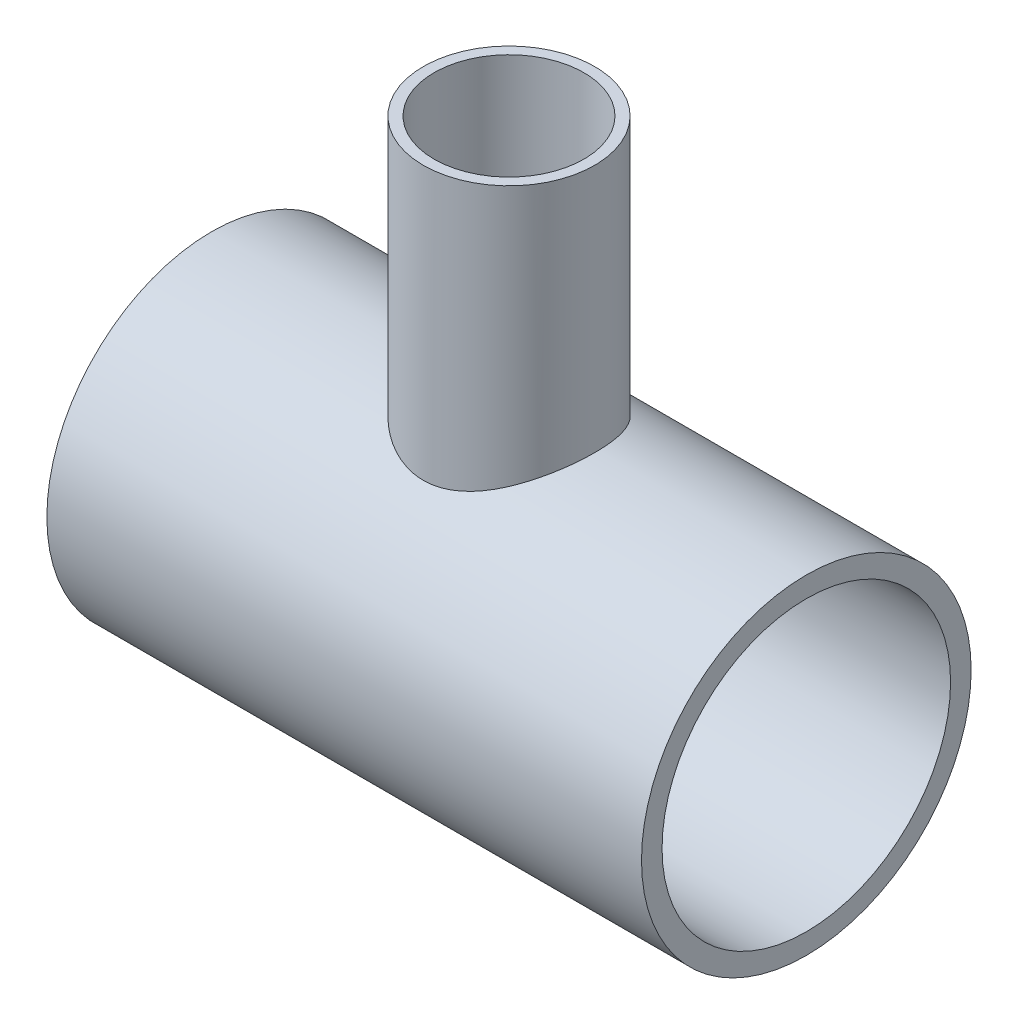
ISO-10303-21;
HEADER;
FILE_DESCRIPTION(('STEP AP214'),'2;1');
FILE_NAME('part.step','',(''),(''),'','','');
FILE_SCHEMA(('AUTOMOTIVE_DESIGN { 1 0 10303 214 1 1 1 1 }'));
ENDSEC;
DATA;
#1=APPLICATION_CONTEXT('core data for automotive mechanical design processes');
#2=APPLICATION_PROTOCOL_DEFINITION('international standard','automotive_design',2000,#1);
#3=PRODUCT_CONTEXT('',#1,'mechanical');
#4=PRODUCT('Part','Part','',(#3));
#5=PRODUCT_RELATED_PRODUCT_CATEGORY('part','',(#4));
#6=PRODUCT_DEFINITION_FORMATION('','',#4);
#7=PRODUCT_DEFINITION_CONTEXT('part definition',#1,'design');
#8=PRODUCT_DEFINITION('design','',#6,#7);
#9=PRODUCT_DEFINITION_SHAPE('','',#8);
#10=(LENGTH_UNIT() NAMED_UNIT(*) SI_UNIT(.MILLI.,.METRE.));
#11=(NAMED_UNIT(*) PLANE_ANGLE_UNIT() SI_UNIT($,.RADIAN.));
#12=(NAMED_UNIT(*) SI_UNIT($,.STERADIAN.) SOLID_ANGLE_UNIT());
#13=UNCERTAINTY_MEASURE_WITH_UNIT(LENGTH_MEASURE(1.E-05),#10,'distance_accuracy_value','');
#14=(GEOMETRIC_REPRESENTATION_CONTEXT(3) GLOBAL_UNCERTAINTY_ASSIGNED_CONTEXT((#13)) GLOBAL_UNIT_ASSIGNED_CONTEXT((#10,
#11,#12)) REPRESENTATION_CONTEXT('',''));
#15=CARTESIAN_POINT('',(0.,0.,0.));
#16=DIRECTION('',(0.,0.,1.));
#17=DIRECTION('',(1.,0.,0.));
#18=AXIS2_PLACEMENT_3D('',#15,#16,#17);
#19=CARTESIAN_POINT('',(-292.1,161.925,0.));
#20=DIRECTION('',(1.,0.,0.));
#21=DIRECTION('',(0.,0.,-1.));
#22=AXIS2_PLACEMENT_3D('',#19,#20,#21);
#23=PLANE('',#22);
#24=CARTESIAN_POINT('',(-292.1,0.,0.));
#25=DIRECTION('',(-1.,0.,0.));
#26=DIRECTION('',(0.,0.,1.));
#27=AXIS2_PLACEMENT_3D('',#24,#25,#26);
#28=CIRCLE('',#27,141.732);
#29=CARTESIAN_POINT('',(-292.1,0.,141.732));
#30=VERTEX_POINT('',#29);
#31=EDGE_CURVE('E10',#30,#30,#28,.T.);
#32=ORIENTED_EDGE('',*,*,#31,.F.);
#33=EDGE_LOOP('',(#32));
#34=FACE_BOUND('',#33,.T.);
#35=CARTESIAN_POINT('',(-292.1,0.,0.));
#36=DIRECTION('',(-1.,0.,0.));
#37=DIRECTION('',(0.,0.,1.));
#38=AXIS2_PLACEMENT_3D('',#35,#36,#37);
#39=CIRCLE('',#38,161.925);
#40=CARTESIAN_POINT('',(-292.1,0.,161.925));
#41=VERTEX_POINT('',#40);
#42=EDGE_CURVE('E46',#41,#41,#39,.T.);
#43=ORIENTED_EDGE('',*,*,#42,.T.);
#44=EDGE_LOOP('',(#43));
#45=FACE_BOUND('',#44,.T.);
#46=ADVANCED_FACE('F32',(#34,#45),#23,.F.);
#47=CARTESIAN_POINT('',(0.,0.,0.));
#48=DIRECTION('',(-1.,0.,0.));
#49=DIRECTION('',(0.,0.,1.));
#50=AXIS2_PLACEMENT_3D('',#47,#48,#49);
#51=CYLINDRICAL_SURFACE('',#50,141.732);
#52=CARTESIAN_POINT('',(0.,121.095148650596,73.6473));
#53=CARTESIAN_POINT('',(0.953807441131773,121.095148834812,73.6472998590983));
#54=CARTESIAN_POINT('',(1.90761916065207,121.106427131064,73.6287649017258));
#55=CARTESIAN_POINT('',(3.81337534801943,121.151431121258,73.5546900482305));
#56=CARTESIAN_POINT('',(4.7653195975043,121.185159299654,73.4991460564409));
#57=CARTESIAN_POINT('',(6.66558030408513,121.274745796661,73.3512326175063));
#58=CARTESIAN_POINT('',(7.61389559545033,121.33061070765,73.2588522003245));
#59=CARTESIAN_POINT('',(9.50483040392671,121.463933890605,73.0375879796479));
#60=CARTESIAN_POINT('',(10.4474492898645,121.541394512172,72.9087002041482));
#61=CARTESIAN_POINT('',(12.3265524266506,121.717305761536,72.6146451297684));
#62=CARTESIAN_POINT('',(13.2630248074926,121.815788958993,72.4494215247036));
#63=CARTESIAN_POINT('',(15.1267327430204,122.032767404578,72.0833458860256));
#64=CARTESIAN_POINT('',(16.0539673000441,122.151264789903,71.8824900473426));
#65=CARTESIAN_POINT('',(17.8973406970957,122.407176940448,71.445831907943));
#66=CARTESIAN_POINT('',(18.8134817059656,122.544587940811,71.2100365614087));
#67=CARTESIAN_POINT('',(20.6334140771599,122.837150771884,70.7041685144363));
#68=CARTESIAN_POINT('',(21.5372041845084,122.992304390638,70.4340923589897));
#69=CARTESIAN_POINT('',(24.2175345675528,123.480573159199,69.5768621385893));
#70=CARTESIAN_POINT('',(25.9740862085565,123.838056884867,68.9400769779369));
#71=CARTESIAN_POINT('',(29.4233675562484,124.607144297281,67.5400362459252));
#72=CARTESIAN_POINT('',(31.1160962043682,125.018748881168,66.7767785780241));
#73=CARTESIAN_POINT('',(34.4304724802344,125.884604570244,65.1298039826774));
#74=CARTESIAN_POINT('',(36.052120902723,126.338855198432,64.2460884025165));
#75=CARTESIAN_POINT('',(39.2179654669398,127.278427353189,62.3639952682743));
#76=CARTESIAN_POINT('',(40.762157849476,127.763750385205,61.3656121567281));
#77=CARTESIAN_POINT('',(43.9020540511952,128.798430594398,59.1652858381241));
#78=CARTESIAN_POINT('',(45.4899952950847,129.349630915087,57.9531209164021));
#79=CARTESIAN_POINT('',(48.5604662590219,130.461126031861,55.4056452670575));
#80=CARTESIAN_POINT('',(50.0429909675051,131.02142125877,54.0703286916552));
#81=CARTESIAN_POINT('',(52.8964735054971,132.137605666543,51.2822500357951));
#82=CARTESIAN_POINT('',(54.2673747247769,132.693492484263,49.8294290979517));
#83=CARTESIAN_POINT('',(56.8898535299258,133.787406456183,46.8130553269121));
#84=CARTESIAN_POINT('',(58.1414271657354,134.325433018776,45.2494988310591));
#85=CARTESIAN_POINT('',(59.9674395625206,135.128830498218,42.7667159516981));
#86=CARTESIAN_POINT('',(60.5872680083997,135.405186611271,41.8840511455615));
#87=CARTESIAN_POINT('',(61.7889611747112,135.947133400804,40.0900772129981));
#88=CARTESIAN_POINT('',(62.3708295044068,136.212725099857,39.178770822069));
#89=CARTESIAN_POINT('',(63.4954456089669,136.731333853161,37.3286143006785));
#90=CARTESIAN_POINT('',(64.0381861388121,136.984348575943,36.3897591142515));
#91=CARTESIAN_POINT('',(65.0830804621645,137.47592467955,34.4861726295281));
#92=CARTESIAN_POINT('',(65.5852390546697,137.71448776851,33.521444408858));
#93=CARTESIAN_POINT('',(66.5475400344737,138.175366007662,31.5679393608836));
#94=CARTESIAN_POINT('',(67.0076987343504,138.397687459282,30.5791720608418));
#95=CARTESIAN_POINT('',(67.884870780324,138.824507570466,28.5790385181722));
#96=CARTESIAN_POINT('',(68.3018890562079,139.02900826604,27.5676748737936));
#97=CARTESIAN_POINT('',(69.0915558800724,139.418650762236,25.5241369027483));
#98=CARTESIAN_POINT('',(69.4642058128544,139.603793167036,24.4919632267699));
#99=CARTESIAN_POINT('',(70.1639281099816,139.953277731939,22.4088193508097));
#100=CARTESIAN_POINT('',(70.4910014208319,140.117620323991,21.3578495416852));
#101=CARTESIAN_POINT('',(71.0754035776143,140.412568301611,19.3196520883119));
#102=CARTESIAN_POINT('',(71.3361403110635,140.544786933992,18.3336336666011));
#103=CARTESIAN_POINT('',(71.8169026529561,140.789416135417,16.3492941121087));
#104=CARTESIAN_POINT('',(72.0369289347847,140.901827032096,15.3509731831124));
#105=CARTESIAN_POINT('',(72.4355459955183,141.106038318023,13.344029459789));
#106=CARTESIAN_POINT('',(72.6141379791617,141.19783930652,12.3354069658795));
#107=CARTESIAN_POINT('',(72.9292881526187,141.360170661375,10.3099082004614));
#108=CARTESIAN_POINT('',(73.0658462419271,141.430700976873,9.29303190922368));
#109=CARTESIAN_POINT('',(73.2963859975414,141.549939938651,7.25375519165352));
#110=CARTESIAN_POINT('',(73.3903909990139,141.598660544728,6.23135810485138));
#111=CARTESIAN_POINT('',(73.5355978163098,141.673975437289,4.18271889695272));
#112=CARTESIAN_POINT('',(73.5867998725363,141.700569848046,3.15647679748426));
#113=CARTESIAN_POINT('',(73.6462146664877,141.731433773791,1.10246895392483));
#114=CARTESIAN_POINT('',(73.6544296746255,141.735704467834,0.0747032931706185));
#115=CARTESIAN_POINT('',(73.6278456492794,141.721891534508,-1.98010733833253));
#116=CARTESIAN_POINT('',(73.5930475183771,141.703808376209,-3.00715232375154));
#117=CARTESIAN_POINT('',(73.485853148075,141.648169026751,-4.96187923033489));
#118=CARTESIAN_POINT('',(73.417296277295,141.612601876174,-5.88983125431735));
#119=CARTESIAN_POINT('',(73.2451759857234,141.523444711221,-7.74169172960341));
#120=CARTESIAN_POINT('',(73.1416098093332,141.469853278147,-8.66559985680974));
#121=CARTESIAN_POINT('',(72.8997932387281,141.344982809151,-10.5075006993611));
#122=CARTESIAN_POINT('',(72.7615486875162,141.273706752955,-11.4254943845386));
#123=CARTESIAN_POINT('',(72.4507467884063,141.113883031421,-13.2542226273771));
#124=CARTESIAN_POINT('',(72.2781861924183,141.025333731147,-14.164956489386));
#125=CARTESIAN_POINT('',(71.899242870827,140.831493680971,-15.9775075478984));
#126=CARTESIAN_POINT('',(71.6928624533553,140.726204073575,-16.8793253484538));
#127=CARTESIAN_POINT('',(71.2468265205092,140.49949672707,-18.6726718568046));
#128=CARTESIAN_POINT('',(71.0071679297142,140.378077497379,-19.5641996053819));
#129=CARTESIAN_POINT('',(70.2391890107711,139.990650175522,-22.2211269251538));
#130=CARTESIAN_POINT('',(69.6617811034016,139.701428939864,-23.969273256017));
#131=CARTESIAN_POINT('',(68.3736334598451,139.063554047005,-27.4303775493643));
#132=CARTESIAN_POINT('',(67.6612856716377,138.714188793218,-29.1426013744962));
#133=CARTESIAN_POINT('',(66.114367352944,137.966250430439,-32.4997042849283));
#134=CARTESIAN_POINT('',(65.2797971246856,137.567677443126,-34.1445835367433));
#135=CARTESIAN_POINT('',(63.4945993739895,136.729579745194,-37.3596400878981));
#136=CARTESIAN_POINT('',(62.5439437071012,136.290045109726,-38.9297991428825));
#137=CARTESIAN_POINT('',(60.5329811156828,135.378999005865,-41.9884915297323));
#138=CARTESIAN_POINT('',(59.472667903372,134.907485704343,-43.4770201734));
#139=CARTESIAN_POINT('',(57.1371753045318,133.893529117168,-46.5111837250457));
#140=CARTESIAN_POINT('',(55.8511125869885,133.348706706947,-48.0476569447557));
#141=CARTESIAN_POINT('',(53.1610808720216,132.244588444829,-51.0080893120744));
#142=CARTESIAN_POINT('',(51.7571049042362,131.685291738649,-52.4320417984252));
#143=CARTESIAN_POINT('',(48.8370854757313,130.565220643002,-55.1621404466109));
#144=CARTESIAN_POINT('',(47.3209507144027,130.004445416128,-56.4681886674447));
#145=CARTESIAN_POINT('',(44.1845350643819,128.895909999696,-58.9547088079694));
#146=CARTESIAN_POINT('',(42.5642504702961,128.348150274147,-60.1351762558354));
#147=CARTESIAN_POINT('',(39.104630623049,127.241233919309,-62.4450588488895));
#148=CARTESIAN_POINT('',(37.2579342943077,126.684144765914,-63.5645202406377));
#149=CARTESIAN_POINT('',(34.411505347312,125.886283135239,-65.1225337346438));
#150=CARTESIAN_POINT('',(33.4497728848507,125.626578354585,-65.621759378017));
#151=CARTESIAN_POINT('',(31.5020858767877,125.122068826907,-66.578676448333));
#152=CARTESIAN_POINT('',(30.5161342872929,124.877262274013,-67.0363729124954));
#153=CARTESIAN_POINT('',(28.5222102670653,124.405040015808,-67.9087013289056));
#154=CARTESIAN_POINT('',(27.5142548914705,124.177611415996,-68.3233652948689));
#155=CARTESIAN_POINT('',(25.4773580232893,123.742236813453,-69.1087566777208));
#156=CARTESIAN_POINT('',(24.448419069347,123.534288470781,-69.4794893729919));
#157=CARTESIAN_POINT('',(22.3713457501157,123.14005248348,-70.1758320846277));
#158=CARTESIAN_POINT('',(21.3232123432171,122.95376376077,-70.5014443469654));
#159=CARTESIAN_POINT('',(19.2097783359276,122.604912404893,-71.1063797863388));
#160=CARTESIAN_POINT('',(18.1444781542842,122.442349193963,-71.3857040906022));
#161=CARTESIAN_POINT('',(16.0855527284308,122.154927554338,-71.8763358201426));
#162=CARTESIAN_POINT('',(15.0930774266831,122.028085458464,-72.0913122759593));
#163=CARTESIAN_POINT('',(13.0975212099845,121.797364317283,-72.480432327439));
#164=CARTESIAN_POINT('',(12.0944406064567,121.693484599642,-72.6545771186561));
#165=CARTESIAN_POINT('',(10.079789188104,121.509797809547,-72.9613654226254));
#166=CARTESIAN_POINT('',(9.06821864046693,121.429989982423,-73.0940102364356));
#167=CARTESIAN_POINT('',(7.03878827309765,121.295319325362,-73.3172718337871));
#168=CARTESIAN_POINT('',(6.02092844138688,121.24045654295,-73.4078885372568));
#169=CARTESIAN_POINT('',(3.98200105199503,121.156322942099,-73.5466642716448));
#170=CARTESIAN_POINT('',(2.96093634783079,121.127033636995,-73.5948539725872));
#171=CARTESIAN_POINT('',(0.91726333804559,121.09431253144,-73.6486815607474));
#172=CARTESIAN_POINT('',(-0.105344976596594,121.090880882696,-73.6543191983102));
#173=CARTESIAN_POINT('',(-2.14959074475858,121.109913587401,-73.6230193641966));
#174=CARTESIAN_POINT('',(-3.17122826304884,121.132376071021,-73.5860849666705));
#175=CARTESIAN_POINT('',(-5.21117706322024,121.202938784037,-73.4698039671252));
#176=CARTESIAN_POINT('',(-6.22948843644301,121.251038303339,-73.3904585398067));
#177=CARTESIAN_POINT('',(-8.13550592698157,121.364867355264,-73.2020441817213));
#178=CARTESIAN_POINT('',(-9.02387055192145,121.427700721698,-73.0978316202783));
#179=CARTESIAN_POINT('',(-10.7947928644372,121.572133694811,-72.857366195883));
#180=CARTESIAN_POINT('',(-11.6773500699473,121.653734839657,-72.7211107067379));
#181=CARTESIAN_POINT('',(-13.4349575637479,121.83500843516,-72.4170000517143));
#182=CARTESIAN_POINT('',(-14.3100093006141,121.934677312577,-72.2491511337882));
#183=CARTESIAN_POINT('',(-16.0514323122231,122.1512855029,-71.8823237508189));
#184=CARTESIAN_POINT('',(-16.9178027758106,122.268226413883,-71.6833424051777));
#185=CARTESIAN_POINT('',(-19.5022315475895,122.64366660548,-71.0404006814231));
#186=CARTESIAN_POINT('',(-21.2055657241922,122.926778994677,-70.550449824722));
#187=CARTESIAN_POINT('',(-24.5628900211693,123.55018067482,-69.4529345917728));
#188=CARTESIAN_POINT('',(-26.2168769630342,123.890473639508,-68.8453626582163));
#189=CARTESIAN_POINT('',(-29.5419057736692,124.635534678918,-67.487552099462));
#190=CARTESIAN_POINT('',(-31.210316660755,125.042527552127,-66.7320912454854));
#191=CARTESIAN_POINT('',(-34.4778095225479,125.897843907492,-65.1040542826059));
#192=CARTESIAN_POINT('',(-36.0768905778605,126.346167937503,-64.2314766212258));
#193=CARTESIAN_POINT('',(-39.2003008137126,127.273223375685,-62.3743828240053));
#194=CARTESIAN_POINT('',(-40.7245995511826,127.751966988276,-61.3898216333069));
#195=CARTESIAN_POINT('',(-43.6924025467978,128.728773711698,-59.3142335844527));
#196=CARTESIAN_POINT('',(-45.1359012993566,129.226838135114,-58.2231994852595));
#197=CARTESIAN_POINT('',(-48.1309010849211,130.30120219205,-55.7814724592548));
#198=CARTESIAN_POINT('',(-49.6697092861298,130.878791262505,-54.4157396884619));
#199=CARTESIAN_POINT('',(-52.6286056417713,132.030100454536,-51.559511913502));
#200=CARTESIAN_POINT('',(-54.0486840088866,132.603820253577,-50.0690066441272));
#201=CARTESIAN_POINT('',(-56.7628110084926,133.733048269162,-46.9697060547426));
#202=CARTESIAN_POINT('',(-58.0568046670205,134.288548472408,-45.3608596687913));
#203=CARTESIAN_POINT('',(-60.5098870263224,135.367158839613,-42.0327259658238));
#204=CARTESIAN_POINT('',(-61.6689763463064,135.890269152236,-40.3134391557846));
#205=CARTESIAN_POINT('',(-63.3184762495591,136.649242819258,-37.6278066316612));
#206=CARTESIAN_POINT('',(-63.8617595969737,136.901957452037,-36.698269379597));
#207=CARTESIAN_POINT('',(-64.9084771793175,137.393346894012,-34.8134451140822));
#208=CARTESIAN_POINT('',(-65.411915662757,137.632023199364,-33.8581608605392));
#209=CARTESIAN_POINT('',(-66.377757208444,138.093670166962,-31.9231534599995));
#210=CARTESIAN_POINT('',(-66.840153200413,138.316638121815,-30.9434261393585));
#211=CARTESIAN_POINT('',(-67.722494198096,138.745171194694,-28.9614410610403));
#212=CARTESIAN_POINT('',(-68.1424443800499,138.950738434228,-27.9591860688649));
#213=CARTESIAN_POINT('',(-68.9384503990677,139.342832853798,-25.9344821695624));
#214=CARTESIAN_POINT('',(-69.3145337880916,139.529371975718,-24.9120464146603));
#215=CARTESIAN_POINT('',(-70.0218701441765,139.882105182286,-22.848457439551));
#216=CARTESIAN_POINT('',(-70.3531284586487,140.04830169348,-21.8073064687939));
#217=CARTESIAN_POINT('',(-70.9697265786516,140.359061731181,-19.7083512193804));
#218=CARTESIAN_POINT('',(-71.2550682904605,140.503626155749,-18.6505476340783));
#219=CARTESIAN_POINT('',(-71.7788175965382,140.76996417718,-16.5205580811134));
#220=CARTESIAN_POINT('',(-72.0172264229447,140.891738372355,-15.4483724918135));
#221=CARTESIAN_POINT('',(-72.4255845733939,141.100930736806,-13.3957725129318));
#222=CARTESIAN_POINT('',(-72.5999126259235,141.190526648039,-12.4164484851673));
#223=CARTESIAN_POINT('',(-72.9089421142242,141.349677419683,-10.4499544101786));
#224=CARTESIAN_POINT('',(-73.0436441980356,141.419232607837,-9.46278449153668));
#225=CARTESIAN_POINT('',(-73.2729721938257,141.537817735858,-7.48262659228661));
#226=CARTESIAN_POINT('',(-73.3676002681077,141.586848783158,-6.48963892852283));
#227=CARTESIAN_POINT('',(-73.5164726132859,141.664048784822,-4.49982525010602));
#228=CARTESIAN_POINT('',(-73.5707167132154,141.692217650865,-3.50299921922111));
#229=CARTESIAN_POINT('',(-73.6386229634145,141.72748843014,-1.50793894651667));
#230=CARTESIAN_POINT('',(-73.6522991764817,141.734597643667,-0.509705312720232));
#231=CARTESIAN_POINT('',(-73.6390624866911,141.727719653415,1.48641845813084));
#232=CARTESIAN_POINT('',(-73.6121496599232,141.713732489182,2.4843085958259));
#233=CARTESIAN_POINT('',(-73.5178292008357,141.664761377957,4.47762429620717));
#234=CARTESIAN_POINT('',(-73.4504227587176,141.629778048089,5.47304993046742));
#235=CARTESIAN_POINT('',(-73.2753457172105,141.539060706622,7.45939200093112));
#236=CARTESIAN_POINT('',(-73.1676757212165,141.483327005991,8.45030850448377));
#237=CARTESIAN_POINT('',(-72.9219904298898,141.356434327024,10.3516643759782));
#238=CARTESIAN_POINT('',(-72.7868502705005,141.286742469942,11.2625749976676));
#239=CARTESIAN_POINT('',(-72.4827876333599,141.130338818636,13.0773406235839));
#240=CARTESIAN_POINT('',(-72.3138624868933,141.043625679893,13.981195064571));
#241=CARTESIAN_POINT('',(-71.9427190214326,140.85369856303,15.780153707665));
#242=CARTESIAN_POINT('',(-71.7405059143411,140.750487168119,16.6752592563826));
#243=CARTESIAN_POINT('',(-71.303305008802,140.528150396634,18.455458723904));
#244=CARTESIAN_POINT('',(-71.0683142120975,140.409023564276,19.3405517188185));
#245=CARTESIAN_POINT('',(-70.3150410381054,140.028750529279,21.9786964324173));
#246=CARTESIAN_POINT('',(-69.7483883123012,139.744675929507,23.7149501036971));
#247=CARTESIAN_POINT('',(-68.4916557300146,139.121689707703,27.1317745941843));
#248=CARTESIAN_POINT('',(-67.8015700294823,138.78277548931,28.8123427724425));
#249=CARTESIAN_POINT('',(-66.2737128294021,138.042658461145,32.1755489647677));
#250=CARTESIAN_POINT('',(-65.4311334963645,137.639504644323,33.8555743600646));
#251=CARTESIAN_POINT('',(-63.6254290062576,136.790334170335,37.1381075009717));
#252=CARTESIAN_POINT('',(-62.6623018950612,136.344316818363,38.7406139893858));
#253=CARTESIAN_POINT('',(-60.6218263827144,135.418661513755,41.8616372487621));
#254=CARTESIAN_POINT('',(-59.544438819394,134.939012053103,43.3801249496022));
#255=CARTESIAN_POINT('',(-57.2818693613099,133.955997922872,46.3266914357073));
#256=CARTESIAN_POINT('',(-56.0966815270945,133.452631947326,47.7547652320927));
#257=CARTESIAN_POINT('',(-54.1772351179403,132.660545680943,49.8979196754098));
#258=CARTESIAN_POINT('',(-53.4780969655132,132.376407331687,50.6464823879195));
#259=CARTESIAN_POINT('',(-52.0496874045593,131.805827841123,52.1133634426487));
#260=CARTESIAN_POINT('',(-51.3204175082836,131.519386815962,52.8316832990515));
#261=CARTESIAN_POINT('',(-49.8327000623511,130.946026717135,54.2372010460506));
#262=CARTESIAN_POINT('',(-49.074253326599,130.659107657017,54.924399803625));
#263=CARTESIAN_POINT('',(-47.528936186375,130.086585175883,56.2669801015363));
#264=CARTESIAN_POINT('',(-46.7420586027221,129.800982107992,56.9223535062118));
#265=CARTESIAN_POINT('',(-44.3389825423156,128.948575691282,58.8403136257973));
#266=CARTESIAN_POINT('',(-42.6813841303124,128.38658155093,60.0537543701152));
#267=CARTESIAN_POINT('',(-39.2639553609221,127.291299328862,62.3417542275663));
#268=CARTESIAN_POINT('',(-37.5041297942758,126.758009904189,63.4163198413007));
#269=CARTESIAN_POINT('',(-34.7539929571321,125.980376936381,64.940351369934));
#270=CARTESIAN_POINT('',(-33.7975665006334,125.71967359751,65.4432609631776));
#271=CARTESIAN_POINT('',(-31.8605574346817,125.212845908056,66.4078290991608));
#272=CARTESIAN_POINT('',(-30.8799803860241,124.966718244972,66.869497026791));
#273=CARTESIAN_POINT('',(-28.895699786332,124.491238226489,67.7505878388198));
#274=CARTESIAN_POINT('',(-27.8919898251494,124.261890596164,68.1699988365642));
#275=CARTESIAN_POINT('',(-25.8632608975249,123.822302949315,68.9652344512355));
#276=CARTESIAN_POINT('',(-24.8382409130628,123.61206384823,69.3410569801905));
#277=CARTESIAN_POINT('',(-22.7717470929322,123.213483970211,70.046848669019));
#278=CARTESIAN_POINT('',(-21.7303293220498,123.025081707347,70.3769471126875));
#279=CARTESIAN_POINT('',(-19.6301946671785,122.671546375981,70.991388254535));
#280=CARTESIAN_POINT('',(-18.5714781786149,122.506412776417,71.2757319969968));
#281=CARTESIAN_POINT('',(-16.4395667891103,122.201399473598,71.7974168458488));
#282=CARTESIAN_POINT('',(-15.3663803857606,122.061505587682,72.034784356364));
#283=CARTESIAN_POINT('',(-13.2075517143609,121.808561666238,72.461684782389));
#284=CARTESIAN_POINT('',(-12.1219115009942,121.695507267536,72.651225473206));
#285=CARTESIAN_POINT('',(-10.1212995035659,121.51400799156,72.9543102964986));
#286=CARTESIAN_POINT('',(-9.20782663857682,121.441276499886,73.0752408953571));
#287=CARTESIAN_POINT('',(-7.37585048093556,121.316130088546,73.2828160829214));
#288=CARTESIAN_POINT('',(-6.45734866289792,121.263709506147,73.3694702281318));
#289=CARTESIAN_POINT('',(-4.61672526514095,121.17963484506,73.5082478771081));
#290=CARTESIAN_POINT('',(-3.69460342950259,121.147982262177,73.5603688936473));
#291=CARTESIAN_POINT('',(-1.84832272065985,121.105736258505,73.6298996668612));
#292=CARTESIAN_POINT('',(-0.924163368619402,121.095148472106,73.6473001365224));
#293=CARTESIAN_POINT('',(0.,121.095148650596,73.6473));
#294=B_SPLINE_CURVE_WITH_KNOTS('',3,(#52,#53,#54,#55,#56,#57,#58,#59,#60,#61,#62,#63,#64,#65,
#66,#67,#68,#69,#70,#71,#72,#73,#74,#75,#76,#77,#78,#79,#80,#81,#82,#83,#84,#85,#86,#87,#88,#89,
#90,#91,#92,#93,#94,#95,#96,#97,#98,#99,#100,#101,#102,#103,#104,#105,#106,#107,#108,#109,#110,
#111,#112,#113,#114,#115,#116,#117,#118,#119,#120,#121,#122,#123,#124,#125,#126,#127,#128,#129,
#130,#131,#132,#133,#134,#135,#136,#137,#138,#139,#140,#141,#142,#143,#144,#145,#146,#147,#148,
#149,#150,#151,#152,#153,#154,#155,#156,#157,#158,#159,#160,#161,#162,#163,#164,#165,#166,#167,
#168,#169,#170,#171,#172,#173,#174,#175,#176,#177,#178,#179,#180,#181,#182,#183,#184,#185,#186,
#187,#188,#189,#190,#191,#192,#193,#194,#195,#196,#197,#198,#199,#200,#201,#202,#203,#204,#205,
#206,#207,#208,#209,#210,#211,#212,#213,#214,#215,#216,#217,#218,#219,#220,#221,#222,#223,#224,
#225,#226,#227,#228,#229,#230,#231,#232,#233,#234,#235,#236,#237,#238,#239,#240,#241,#242,#243,
#244,#245,#246,#247,#248,#249,#250,#251,#252,#253,#254,#255,#256,#257,#258,#259,#260,#261,#262,
#263,#264,#265,#266,#267,#268,#269,#270,#271,#272,#273,#274,#275,#276,#277,#278,#279,#280,#281,
#282,#283,#284,#285,#286,#287,#288,#289,#290,#291,#292,#293),.UNSPECIFIED.,.T.,.F.,(4,2,2,2,2,2,
2,2,2,2,2,2,2,2,2,2,2,2,2,2,2,2,2,2,2,2,2,2,2,2,2,2,2,2,2,2,2,2,2,2,2,2,2,2,2,2,2,2,2,2,2,2,2,2,
2,2,2,2,2,2,2,2,2,2,2,2,2,2,2,2,2,2,2,2,2,2,2,2,2,2,2,2,2,2,2,2,2,2,2,2,2,2,2,2,2,2,2,2,2,2,2,2,
2,2,2,2,2,2,2,2,2,2,2,2,2,2,2,2,2,2,4),(0.,2.86118366779168,5.72268402586543,8.58503718755091,
11.4477018933007,14.3148342541664,17.1822729728466,20.0491417357894,22.9162996673034,
28.6163242695485,34.3164433708778,40.0164987233615,45.7168304508138,51.9274301098859,
58.1383248274083,64.3523500521443,70.5665809062317,73.9058798037564,77.2448607352655,
80.5844583428505,83.9236604482448,87.2615600533502,90.5990778042433,93.9364913589682,
97.2738355941637,100.358125905709,103.44236519592,106.526514797928,109.610671774231,
112.693135412484,115.775581737949,118.85786525864,121.940084102232,124.732737071002,
127.525609901978,130.318012474021,133.110679479096,135.903155969838,138.695890700787,
144.280122697675,149.935644813003,155.591152943761,161.248034962433,166.905241527639,
173.127863643561,179.35085386483,185.578966741928,191.807301322665,198.488523592187,
201.830418796061,205.171908106376,208.510893445528,211.849477194873,215.187894698806,
218.526230891952,221.59528482477,224.664248884231,227.733116719522,230.801990401567,
233.868643801972,236.935315194563,240.001765154978,243.068130185256,245.757334718604,
248.446759732192,251.135653439784,253.824796090613,259.20320809082,264.581965775806,
270.204763194395,275.827635155038,281.452777448378,287.078302564823,293.482222122593,
299.886669058547,306.293896006468,312.701093544097,316.017937030996,319.334426377353,
322.651485941968,325.968140503939,329.282700586778,332.596864909642,335.910891605822,
339.224831286652,342.220077826541,345.215275379658,348.210311298052,351.205359895945,
354.199370143305,357.193374777976,360.187291416199,363.181163188981,365.95090714451,
368.720869971814,371.490399517264,374.260182564829,379.798716095819,385.33751192332,
391.098131514675,396.858844500052,402.621538359996,408.384549918584,411.572683129086,
414.760656527542,417.94854106005,421.137236281795,427.519089292515,433.900643467017,
437.234468661266,440.567533272469,443.901532854981,447.2356920766,450.560222717359,
453.884677469887,457.207258291958,460.529298606508,463.301390093528,466.072708157222,
468.844225801671,471.616484669275),.UNSPECIFIED.);
#295=CARTESIAN_POINT('',(0.,121.095148650596,73.6473));
#296=VERTEX_POINT('',#295);
#297=EDGE_CURVE('E100',#296,#296,#294,.T.);
#298=ORIENTED_EDGE('',*,*,#297,.T.);
#299=EDGE_LOOP('',(#298));
#300=FACE_BOUND('',#299,.T.);
#301=CARTESIAN_POINT('',(292.1,0.,0.));
#302=DIRECTION('',(-1.,0.,0.));
#303=DIRECTION('',(0.,0.,1.));
#304=AXIS2_PLACEMENT_3D('',#301,#302,#303);
#305=CIRCLE('',#304,141.732);
#306=CARTESIAN_POINT('',(292.1,0.,141.732));
#307=VERTEX_POINT('',#306);
#308=EDGE_CURVE('E38',#307,#307,#305,.T.);
#309=ORIENTED_EDGE('',*,*,#308,.F.);
#310=EDGE_LOOP('',(#309));
#311=FACE_BOUND('',#310,.T.);
#312=ORIENTED_EDGE('',*,*,#31,.T.);
#313=EDGE_LOOP('',(#312));
#314=FACE_BOUND('',#313,.T.);
#315=ADVANCED_FACE('F83',(#300,#311,#314),#51,.F.);
#316=CARTESIAN_POINT('',(292.1,161.925,0.));
#317=DIRECTION('',(-1.,0.,0.));
#318=DIRECTION('',(0.,0.,1.));
#319=AXIS2_PLACEMENT_3D('',#316,#317,#318);
#320=PLANE('',#319);
#321=CARTESIAN_POINT('',(292.1,0.,0.));
#322=DIRECTION('',(-1.,0.,0.));
#323=DIRECTION('',(0.,0.,1.));
#324=AXIS2_PLACEMENT_3D('',#321,#322,#323);
#325=CIRCLE('',#324,161.925);
#326=CARTESIAN_POINT('',(292.1,0.,161.925));
#327=VERTEX_POINT('',#326);
#328=EDGE_CURVE('E42',#327,#327,#325,.T.);
#329=ORIENTED_EDGE('',*,*,#328,.F.);
#330=EDGE_LOOP('',(#329));
#331=FACE_BOUND('',#330,.T.);
#332=ORIENTED_EDGE('',*,*,#308,.T.);
#333=EDGE_LOOP('',(#332));
#334=FACE_BOUND('',#333,.T.);
#335=ADVANCED_FACE('F78',(#331,#334),#320,.F.);
#336=CARTESIAN_POINT('',(0.,0.,0.));
#337=DIRECTION('',(-1.,0.,0.));
#338=DIRECTION('',(0.,0.,1.));
#339=AXIS2_PLACEMENT_3D('',#336,#337,#338);
#340=CYLINDRICAL_SURFACE('',#339,161.925);
#341=CARTESIAN_POINT('',(0.,138.34950928265,84.1375));
#342=CARTESIAN_POINT('',(1.08967187216687,138.349509493883,84.1374998384068));
#343=CARTESIAN_POINT('',(2.17934865044386,138.362393848498,84.1163245721413));
#344=CARTESIAN_POINT('',(4.35656900525236,138.413806527536,84.0316977338507));
#345=CARTESIAN_POINT('',(5.4441123322942,138.45233769049,83.968241482262));
#346=CARTESIAN_POINT('',(7.61505453109698,138.554681560023,83.7992577121321));
#347=CARTESIAN_POINT('',(8.69845207092077,138.61850179872,83.6937176592586));
#348=CARTESIAN_POINT('',(10.8587401144443,138.770810614655,83.4409342201258));
#349=CARTESIAN_POINT('',(11.9356298970755,138.85930187607,83.2936862960722));
#350=CARTESIAN_POINT('',(14.0824012048997,139.060263492384,82.9577428269468));
#351=CARTESIAN_POINT('',(15.1522691682779,139.172771058092,82.7689829494584));
#352=CARTESIAN_POINT('',(17.2814526182041,139.420648074337,82.3507594077303));
#353=CARTESIAN_POINT('',(18.3407669649986,139.556019966395,82.1212913964206));
#354=CARTESIAN_POINT('',(20.4467194863061,139.848375096097,81.6224306813658));
#355=CARTESIAN_POINT('',(21.4933601387278,140.005354032496,81.3530459229066));
#356=CARTESIAN_POINT('',(23.572532723888,140.339579173679,80.775116114389));
#357=CARTESIAN_POINT('',(24.6050632229022,140.516827421125,80.4665671171683));
#358=CARTESIAN_POINT('',(27.6671939780229,141.07462825316,79.4872225639799));
#359=CARTESIAN_POINT('',(29.6739583805912,141.483019748391,78.7597256990905));
#360=CARTESIAN_POINT('',(33.6145740685683,142.361630041832,77.1602450728173));
#361=CARTESIAN_POINT('',(35.5484241443635,142.831849865163,76.2882589157196));
#362=CARTESIAN_POINT('',(39.3349176549234,143.821009450819,74.4066671633703));
#363=CARTESIAN_POINT('',(41.187562001353,144.339948665984,73.3970631136242));
#364=CARTESIAN_POINT('',(44.8043649804555,145.413322896144,71.2468587048719));
#365=CARTESIAN_POINT('',(46.5685193186797,145.967759630878,70.1062519970841));
#366=CARTESIAN_POINT('',(50.1556658451915,147.149782939416,67.5924873268612));
#367=CARTESIAN_POINT('',(51.9697902149469,147.779474994173,66.2076522972216));
#368=CARTESIAN_POINT('',(55.4776117072051,149.049248438677,63.2972952731374));
#369=CARTESIAN_POINT('',(57.1713031045059,149.689330320567,61.7717665982369));
#370=CARTESIAN_POINT('',(60.4312262155366,150.964460237198,58.5865348366586));
#371=CARTESIAN_POINT('',(61.9973932584167,151.599505572247,56.926764512616));
#372=CARTESIAN_POINT('',(64.9934058953182,152.849192806815,53.4807196322052));
#373=CARTESIAN_POINT('',(66.4232469770025,153.463834030527,51.6944408918651));
#374=CARTESIAN_POINT('',(68.5093412712146,154.381632535215,48.8580019917102));
#375=CARTESIAN_POINT('',(69.2174502170584,154.697339623382,47.8496111799648));
#376=CARTESIAN_POINT('',(70.5902968799336,155.316455268651,45.8001057269521));
#377=CARTESIAN_POINT('',(71.2550387203329,155.619864993951,44.7589942107753));
#378=CARTESIAN_POINT('',(72.5398295854972,156.212319082809,42.645304733888));
#379=CARTESIAN_POINT('',(73.1598703335602,156.501360782972,41.5727209973525));
#380=CARTESIAN_POINT('',(74.3535840342813,157.062932615578,39.3979922606222));
#381=CARTESIAN_POINT('',(74.9272624694233,157.335464699376,38.29585077631));
#382=CARTESIAN_POINT('',(76.0266184872868,157.861967160186,36.0640944183245));
#383=CARTESIAN_POINT('',(76.5523147078389,158.115944736647,34.9344904297418));
#384=CARTESIAN_POINT('',(77.5544164504859,158.603539134025,32.6494650384374));
#385=CARTESIAN_POINT('',(78.030827598129,158.837158278235,31.4940466006029));
#386=CARTESIAN_POINT('',(78.9329603725174,159.282280940953,29.1594354999728));
#387=CARTESIAN_POINT('',(79.3586835842867,159.493785150975,27.9802435819289));
#388=CARTESIAN_POINT('',(80.1580606950523,159.893031390474,25.6003864957747));
#389=CARTESIAN_POINT('',(80.531715675292,160.080773913374,24.3997217741506));
#390=CARTESIAN_POINT('',(81.1993500978393,160.417719044436,22.0712055803332));
#391=CARTESIAN_POINT('',(81.49722247045,160.568764457269,20.9447354035358));
#392=CARTESIAN_POINT('',(82.0464549134504,160.848225272973,18.6777482737152));
#393=CARTESIAN_POINT('',(82.297816082502,160.97664121038,17.5372316531681));
#394=CARTESIAN_POINT('',(82.7532020181437,161.209928110975,15.2444255493623));
#395=CARTESIAN_POINT('',(82.9572279933938,161.314799675345,14.0921363674894));
#396=CARTESIAN_POINT('',(83.317258922555,161.500243149741,11.7781289159965));
#397=CARTESIAN_POINT('',(83.47326376165,161.580815001669,10.6164106238387));
#398=CARTESIAN_POINT('',(83.7366318911338,161.717029221294,8.28666905151409));
#399=CARTESIAN_POINT('',(83.8440220768595,161.772685373043,7.11864962020266));
#400=CARTESIAN_POINT('',(84.009903795791,161.858721177466,4.7782068611832));
#401=CARTESIAN_POINT('',(84.068395123405,161.889100723865,3.60578351498005));
#402=CARTESIAN_POINT('',(84.1362645608041,161.924355473497,1.25920215021293));
#403=CARTESIAN_POINT('',(84.1456455053325,161.929232148802,0.0850442356849944));
#404=CARTESIAN_POINT('',(84.115266585278,161.913447886682,-2.26244806555919));
#405=CARTESIAN_POINT('',(84.0755077517601,161.892787485082,-3.43578246903772));
#406=CARTESIAN_POINT('',(83.9530369284303,161.829220823332,-5.66893771227912));
#407=CARTESIAN_POINT('',(83.874711064554,161.788586788789,-6.72906714329691));
#408=CARTESIAN_POINT('',(83.6780655790626,161.686728862936,-8.84471415788139));
#409=CARTESIAN_POINT('',(83.5597425243377,161.62550320417,-9.90023133768084));
#410=CARTESIAN_POINT('',(83.2834720588026,161.482845693585,-12.004502684705));
#411=CARTESIAN_POINT('',(83.1255314643162,161.401417317733,-13.0532579835274));
#412=CARTESIAN_POINT('',(82.7704480818115,161.218828334287,-15.1424792021223));
#413=CARTESIAN_POINT('',(82.5733015828925,161.117665858846,-16.1829443275136));
#414=CARTESIAN_POINT('',(82.1403742550823,160.896218753382,-18.253673057883));
#415=CARTESIAN_POINT('',(81.9045960627249,160.775935428335,-19.283937353962));
#416=CARTESIAN_POINT('',(81.3950030485497,160.516930886661,-21.332765554033));
#417=CARTESIAN_POINT('',(81.1211847112411,160.378207965985,-22.3513283671991));
#418=CARTESIAN_POINT('',(80.536238267165,160.083130231045,-24.3750370061552));
#419=CARTESIAN_POINT('',(80.2251125676075,159.926776554422,-25.380183692958));
#420=CARTESIAN_POINT('',(79.5663001471931,159.597310882542,-27.3756695149081));
#421=CARTESIAN_POINT('',(79.2186100706792,159.424197349282,-28.3660072814396));
#422=CARTESIAN_POINT('',(78.1126028498717,158.876525218972,-31.337571628868));
#423=CARTESIAN_POINT('',(77.2986940053913,158.477367488036,-33.2939541279063));
#424=CARTESIAN_POINT('',(75.5313429942371,157.622880984357,-37.1294469237671));
#425=CARTESIAN_POINT('',(74.5779011724425,157.16755235045,-39.0085574115656));
#426=CARTESIAN_POINT('',(72.5384004827309,156.210100152788,-42.6815240709415));
#427=CARTESIAN_POINT('',(71.4523094525079,155.707965247338,-44.4753594195438));
#428=CARTESIAN_POINT('',(69.1548630238683,154.667168786963,-47.9697522592526));
#429=CARTESIAN_POINT('',(67.9435004425555,154.128505138142,-49.6703043930639));
#430=CARTESIAN_POINT('',(65.275303655692,152.970149201204,-53.1366464603331));
#431=CARTESIAN_POINT('',(63.8060361038162,152.347739133339,-54.8919706437622));
#432=CARTESIAN_POINT('',(60.7328001424769,151.086386515989,-58.2740750215848));
#433=CARTESIAN_POINT('',(59.1288237700215,150.447442990716,-59.9008476059082));
#434=CARTESIAN_POINT('',(55.7928401831646,149.167869902307,-63.0198047753881));
#435=CARTESIAN_POINT('',(54.0607286726856,148.527239384272,-64.5118774784048));
#436=CARTESIAN_POINT('',(50.4775249226746,147.260849185489,-67.3525573034027));
#437=CARTESIAN_POINT('',(48.6264284505247,146.635090034841,-68.7011593172064));
#438=CARTESIAN_POINT('',(44.673996719516,145.370559456065,-71.3400263230323));
#439=CARTESIAN_POINT('',(42.5642528061335,144.734149863265,-72.6189207989689));
#440=CARTESIAN_POINT('',(39.3123743289314,143.822688090599,-74.3988230344759));
#441=CARTESIAN_POINT('',(38.2136516432825,143.526006764542,-74.969146773144));
#442=CARTESIAN_POINT('',(35.9885347413947,142.949666442028,-76.062343853399));
#443=CARTESIAN_POINT('',(34.862143902213,142.670005382497,-76.5852229496673));
#444=CARTESIAN_POINT('',(32.584205516561,142.130551016847,-77.5817825211287));
#445=CARTESIAN_POINT('',(31.4326774532624,141.870742980229,-78.0554995687895));
#446=CARTESIAN_POINT('',(29.1056468161653,141.373384196849,-78.9527388128233));
#447=CARTESIAN_POINT('',(27.9301471424751,141.135830776928,-79.3762670393555));
#448=CARTESIAN_POINT('',(25.5572191033337,140.685469382827,-80.1717736164733));
#449=CARTESIAN_POINT('',(24.3597918326351,140.47266017715,-80.543754532698));
#450=CARTESIAN_POINT('',(21.9453257536105,140.074146594327,-81.2348340083381));
#451=CARTESIAN_POINT('',(20.7282874236367,139.888441557164,-81.5539338554908));
#452=CARTESIAN_POINT('',(18.3760948065698,139.560104726465,-82.1144297086175));
#453=CARTESIAN_POINT('',(17.2422541735395,139.415206811294,-82.3600173062152));
#454=CARTESIAN_POINT('',(14.9624574087326,139.151643914187,-82.8045435926284));
#455=CARTESIAN_POINT('',(13.816501632689,139.032978164234,-83.0034836471865));
#456=CARTESIAN_POINT('',(11.5148912771084,138.823147092652,-83.3539512881349));
#457=CARTESIAN_POINT('',(10.3592370028039,138.731980908864,-83.505480360947));
#458=CARTESIAN_POINT('',(8.04074403846271,138.578145443073,-83.7605243222552));
#459=CARTESIAN_POINT('',(6.87790533474024,138.515476215372,-83.8640391192595));
#460=CARTESIAN_POINT('',(4.54856380153871,138.419373652217,-84.0225637673322));
#461=CARTESIAN_POINT('',(3.38206423108217,138.385919201014,-84.0776086515476));
#462=CARTESIAN_POINT('',(1.04730214100533,138.348549489579,-84.1390859377284));
#463=CARTESIAN_POINT('',(-0.120960388916794,138.344634402634,-84.1455180545173));
#464=CARTESIAN_POINT('',(-2.45637577697059,138.366387309026,-84.109743269732));
#465=CARTESIAN_POINT('',(-3.6235287091265,138.392053166614,-84.0675398796487));
#466=CARTESIAN_POINT('',(-5.95403453109123,138.472672995149,-83.934680068135));
#467=CARTESIAN_POINT('',(-7.11738752524023,138.527626154994,-83.8440249885557));
#468=CARTESIAN_POINT('',(-9.29489726024812,138.657672439109,-83.628758033965));
#469=CARTESIAN_POINT('',(-10.3098064092469,138.729457363508,-83.5096936933911));
#470=CARTESIAN_POINT('',(-12.3329940167981,138.894466832773,-83.2349590360665));
#471=CARTESIAN_POINT('',(-13.3412719248908,138.98769313495,-83.0792857188627));
#472=CARTESIAN_POINT('',(-15.3492373769809,139.194786901259,-82.73184268039));
#473=CARTESIAN_POINT('',(-16.348926578608,139.308650284212,-82.5400800958303));
#474=CARTESIAN_POINT('',(-18.3384394860025,139.556120239934,-82.1209725563263));
#475=CARTESIAN_POINT('',(-19.3282622698378,139.689728639583,-81.8936243087532));
#476=CARTESIAN_POINT('',(-21.2966742203893,139.975664893189,-81.403926683802));
#477=CARTESIAN_POINT('',(-22.2752613774314,140.127996040689,-81.1415711475485));
#478=CARTESIAN_POINT('',(-24.2196952795692,140.450206728972,-80.582560108505));
#479=CARTESIAN_POINT('',(-25.1855409073018,140.620087797403,-80.2859016195166));
#480=CARTESIAN_POINT('',(-28.0619745335003,141.154219249277,-79.3455280004362));
#481=CARTESIAN_POINT('',(-29.9518054838127,141.543008877812,-78.6513283401566));
#482=CARTESIAN_POINT('',(-33.7506558100081,142.394208643127,-77.1000134810882));
#483=CARTESIAN_POINT('',(-35.6566553479515,142.859158723766,-76.2369355611904));
#484=CARTESIAN_POINT('',(-39.3895361900201,143.836285501202,-74.3769574256277));
#485=CARTESIAN_POINT('',(-41.2164164447814,144.348462824093,-73.3800554357646));
#486=CARTESIAN_POINT('',(-44.7847513495946,145.407551325697,-71.2583722518179));
#487=CARTESIAN_POINT('',(-46.5261712088941,145.954476445641,-70.1335395855677));
#488=CARTESIAN_POINT('',(-49.9167114827278,147.070397066538,-67.7622399118352));
#489=CARTESIAN_POINT('',(-51.565825608007,147.639394066898,-66.5157646320644));
#490=CARTESIAN_POINT('',(-54.9874190843228,148.86675762742,-63.7261763688674));
#491=CARTESIAN_POINT('',(-56.7453980430384,149.526596893202,-62.1658823931604));
#492=CARTESIAN_POINT('',(-60.125723647109,150.84185344747,-58.9027615239191));
#493=CARTESIAN_POINT('',(-61.7480591114727,151.497270367341,-57.1999229036434));
#494=CARTESIAN_POINT('',(-64.8487457471482,152.787296896561,-53.6591075178866));
#495=CARTESIAN_POINT('',(-66.3270341228716,153.421897351964,-51.8210724224285));
#496=CARTESIAN_POINT('',(-69.1294872856447,154.654093382625,-48.0188315885885));
#497=CARTESIAN_POINT('',(-70.4536527808265,155.251689127899,-46.0546264299711));
#498=CARTESIAN_POINT('',(-72.3380634936122,156.118728242622,-42.9864263409849));
#499=CARTESIAN_POINT('',(-72.9587140449226,156.40742357274,-41.9244823132765));
#500=CARTESIAN_POINT('',(-74.1544898217246,156.968774672993,-39.7711777501853));
#501=CARTESIAN_POINT('',(-74.7296199009226,157.241432152395,-38.6798203677368));
#502=CARTESIAN_POINT('',(-75.8329994835549,157.768804555746,-36.4691867393688));
#503=CARTESIAN_POINT('',(-76.3612409099762,158.023516386834,-35.3499057257162));
#504=CARTESIAN_POINT('',(-77.3692260586826,158.513058671095,-33.0856051633033));
#505=CARTESIAN_POINT('',(-77.8489756944336,158.747891547893,-31.940588773782));
#506=CARTESIAN_POINT('',(-78.7583284057287,159.195805625787,-29.6274867857324));
#507=CARTESIAN_POINT('',(-79.1879629558076,159.408900468681,-28.4594162111933));
#508=CARTESIAN_POINT('',(-79.9960161326897,159.811847718916,-26.1018926677607));
#509=CARTESIAN_POINT('',(-80.3744408684813,160.001702898334,-24.9124422685488));
#510=CARTESIAN_POINT('',(-81.0788314290329,160.356699536536,-22.5145172528562));
#511=CARTESIAN_POINT('',(-81.4047994312623,160.52184202112,-21.3060434283216));
#512=CARTESIAN_POINT('',(-82.0031163417114,160.826090619296,-18.8726659553585));
#513=CARTESIAN_POINT('',(-82.2754666574848,160.965197416364,-17.6477627391309));
#514=CARTESIAN_POINT('',(-82.7419593024307,161.204163824843,-15.3027959753835));
#515=CARTESIAN_POINT('',(-82.9411038642554,161.306511212096,-14.1839779540669));
#516=CARTESIAN_POINT('',(-83.294122028206,161.488310931194,-11.9373791600759));
#517=CARTESIAN_POINT('',(-83.4479963706173,161.567763637425,-10.809598534273));
#518=CARTESIAN_POINT('',(-83.709960569194,161.703220899222,-8.54739133274841));
#519=CARTESIAN_POINT('',(-83.8180528956458,161.759226719924,-7.41296511895593));
#520=CARTESIAN_POINT('',(-83.9881016701286,161.847405451224,-5.13972841061701));
#521=CARTESIAN_POINT('',(-84.050057922844,161.879578260926,-4.00091789753032));
#522=CARTESIAN_POINT('',(-84.1276082455097,161.919856996551,-1.72168879766226));
#523=CARTESIAN_POINT('',(-84.1432183793323,161.927971261324,-0.581270905159294));
#524=CARTESIAN_POINT('',(-84.1280683058094,161.920099286693,1.69917176253669));
#525=CARTESIAN_POINT('',(-84.0973081853648,161.904113092454,2.83919653846243));
#526=CARTESIAN_POINT('',(-83.9895254328136,161.848154097733,5.11642972321593));
#527=CARTESIAN_POINT('',(-83.9125041601945,161.80818200213,6.25363821382045));
#528=CARTESIAN_POINT('',(-83.7124624831506,161.704532303171,8.52290342549694));
#529=CARTESIAN_POINT('',(-83.5894427679803,161.64085505502,9.65496022350615));
#530=CARTESIAN_POINT('',(-83.3087364081767,161.495879150036,11.8271405629431));
#531=CARTESIAN_POINT('',(-83.1543340634117,161.416256341591,12.8678025559177));
#532=CARTESIAN_POINT('',(-82.80693332291,161.237566117516,14.9410692753907));
#533=CARTESIAN_POINT('',(-82.6139318781641,161.138497165815,15.9736733586818));
#534=CARTESIAN_POINT('',(-82.1898990384837,160.921512086812,18.0288697847813));
#535=CARTESIAN_POINT('',(-81.9588735967531,160.80359890993,19.0514636683198));
#536=CARTESIAN_POINT('',(-81.4593580108749,160.549579535168,21.0852676790783));
#537=CARTESIAN_POINT('',(-81.1908644394373,160.41347167303,22.0964767557511));
#538=CARTESIAN_POINT('',(-80.6171069758412,160.123837370429,24.1058609773553));
#539=CARTESIAN_POINT('',(-80.3118441811401,159.970311449853,25.104036510316));
#540=CARTESIAN_POINT('',(-79.6652807355077,159.646689618027,27.085954182094));
#541=CARTESIAN_POINT('',(-79.3239769444418,159.476592263062,28.0696950547478));
#542=CARTESIAN_POINT('',(-78.2471839038614,158.942815435527,30.9970766977193));
#543=CARTESIAN_POINT('',(-77.4586997554434,158.555593641221,32.9172720913617));
#544=CARTESIAN_POINT('',(-75.7130962869209,157.710030634126,36.7597221277886));
#545=CARTESIAN_POINT('',(-74.7504876891247,157.249462128866,38.6789790012658));
#546=CARTESIAN_POINT('',(-72.6875260641767,156.279347989956,42.4290213777025));
#547=CARTESIAN_POINT('',(-71.5871708037893,155.769801562276,44.2598054456182));
#548=CARTESIAN_POINT('',(-69.255975142396,154.712305224709,47.825393507031));
#549=CARTESIAN_POINT('',(-68.025090000299,154.164342168895,49.5601642784175));
#550=CARTESIAN_POINT('',(-65.440167979585,153.041325035742,52.9264228308169));
#551=CARTESIAN_POINT('',(-64.0861243155878,152.466269466592,54.5579049127632));
#552=CARTESIAN_POINT('',(-61.8932167105909,151.561377901009,57.0063119460758));
#553=CARTESIAN_POINT('',(-61.0944760431616,151.236775318829,57.8614901673599));
#554=CARTESIAN_POINT('',(-59.4625692322882,150.584940335552,59.5372937253108));
#555=CARTESIAN_POINT('',(-58.629404816596,150.257708067104,60.3579207919603));
#556=CARTESIAN_POINT('',(-56.9297423240832,149.602698393772,61.9636191636966));
#557=CARTESIAN_POINT('',(-56.0632451771795,149.27492100434,62.7486914593624));
#558=CARTESIAN_POINT('',(-54.2977786126256,148.620870249784,64.2824860256951));
#559=CARTESIAN_POINT('',(-53.3988009929491,148.29459728835,65.031199001365));
#560=CARTESIAN_POINT('',(-50.6533795340947,147.320809869508,67.2223164997606));
#561=CARTESIAN_POINT('',(-48.7596389422847,146.678791109791,68.6085734645088));
#562=CARTESIAN_POINT('',(-44.8553649753526,145.427552254247,71.2224197615196));
#563=CARTESIAN_POINT('',(-42.8448370744158,144.81833062369,72.4500165219957));
#564=CARTESIAN_POINT('',(-39.7029334238366,143.929982269173,74.1910762323649));
#565=CARTESIAN_POINT('',(-38.6102686484861,143.632164105235,74.7655973124206));
#566=CARTESIAN_POINT('',(-36.3973433464224,143.053183849633,75.8675124876691));
#567=CARTESIAN_POINT('',(-35.2770891724224,142.772017973468,76.3949173047558));
#568=CARTESIAN_POINT('',(-33.0101614763008,142.228851281652,77.4014643952401));
#569=CARTESIAN_POINT('',(-31.8634806313599,141.966855864172,77.8805930888688));
#570=CARTESIAN_POINT('',(-29.545776067017,141.46469439667,78.789055588687));
#571=CARTESIAN_POINT('',(-28.3747511846441,141.224529392494,79.2183870094696));
#572=CARTESIAN_POINT('',(-26.0139054140442,140.769216690636,80.0246651827667));
#573=CARTESIAN_POINT('',(-24.8241485733059,140.553998748262,80.4017596367362));
#574=CARTESIAN_POINT('',(-22.4248732277979,140.150146102112,81.103675453984));
#575=CARTESIAN_POINT('',(-21.2153551747056,139.961510791689,81.4284980101927));
#576=CARTESIAN_POINT('',(-18.7797799612827,139.613090538699,82.0244456492867));
#577=CARTESIAN_POINT('',(-17.5537325083644,139.453289393146,82.2956008981752));
#578=CARTESIAN_POINT('',(-15.0874091252728,139.164353626916,82.7832635816331));
#579=CARTESIAN_POINT('',(-13.8471355422996,139.035214021503,82.9997798993729));
#580=CARTESIAN_POINT('',(-11.5616765608833,138.827904253636,83.345978662109));
#581=CARTESIAN_POINT('',(-10.5182041649286,138.744834722238,83.4841036915924));
#582=CARTESIAN_POINT('',(-8.42551450634676,138.601900163829,83.7211927198425));
#583=CARTESIAN_POINT('',(-7.3762989277648,138.542028669219,83.8201676338008));
#584=CARTESIAN_POINT('',(-5.27373385835826,138.44600393234,83.9786771045284));
#585=CARTESIAN_POINT('',(-4.22038407521821,138.409852398767,84.0382088199602));
#586=CARTESIAN_POINT('',(-2.11135809421408,138.361601753999,84.1176256496746));
#587=CARTESIAN_POINT('',(-1.05568134951094,138.349509078006,84.1375001565526));
#588=CARTESIAN_POINT('',(0.,138.34950928265,84.1375));
#589=B_SPLINE_CURVE_WITH_KNOTS('',3,(#341,#342,#343,#344,#345,#346,#347,#348,#349,#350,#351,
#352,#353,#354,#355,#356,#357,#358,#359,#360,#361,#362,#363,#364,#365,#366,#367,#368,#369,#370,
#371,#372,#373,#374,#375,#376,#377,#378,#379,#380,#381,#382,#383,#384,#385,#386,#387,#388,#389,
#390,#391,#392,#393,#394,#395,#396,#397,#398,#399,#400,#401,#402,#403,#404,#405,#406,#407,#408,
#409,#410,#411,#412,#413,#414,#415,#416,#417,#418,#419,#420,#421,#422,#423,#424,#425,#426,#427,
#428,#429,#430,#431,#432,#433,#434,#435,#436,#437,#438,#439,#440,#441,#442,#443,#444,#445,#446,
#447,#448,#449,#450,#451,#452,#453,#454,#455,#456,#457,#458,#459,#460,#461,#462,#463,#464,#465,
#466,#467,#468,#469,#470,#471,#472,#473,#474,#475,#476,#477,#478,#479,#480,#481,#482,#483,#484,
#485,#486,#487,#488,#489,#490,#491,#492,#493,#494,#495,#496,#497,#498,#499,#500,#501,#502,#503,
#504,#505,#506,#507,#508,#509,#510,#511,#512,#513,#514,#515,#516,#517,#518,#519,#520,#521,#522,
#523,#524,#525,#526,#527,#528,#529,#530,#531,#532,#533,#534,#535,#536,#537,#538,#539,#540,#541,
#542,#543,#544,#545,#546,#547,#548,#549,#550,#551,#552,#553,#554,#555,#556,#557,#558,#559,#560,
#561,#562,#563,#564,#565,#566,#567,#568,#569,#570,#571,#572,#573,#574,#575,#576,#577,#578,#579,
#580,#581,#582,#583,#584,#585,#586,#587,#588),.UNSPECIFIED.,.T.,.F.,(4,2,2,2,2,2,2,2,2,2,2,2,2,
2,2,2,2,2,2,2,2,2,2,2,2,2,2,2,2,2,2,2,2,2,2,2,2,2,2,2,2,2,2,2,2,2,2,2,2,2,2,2,2,2,2,2,2,2,2,2,2,
2,2,2,2,2,2,2,2,2,2,2,2,2,2,2,2,2,2,2,2,2,2,2,2,2,2,2,2,2,2,2,2,2,2,2,2,2,2,2,2,2,2,2,2,2,2,2,2,
2,2,2,2,2,2,2,2,2,2,2,2,2,2,4),(0.,3.26874300080318,6.53784783879121,9.80792708233038,
13.0783622455051,16.353901878347,19.6297915046386,22.9050299505351,26.1805987533638,
32.6925624149429,39.2046340593651,45.7166325765729,52.228946818019,59.3241762593814,
66.4197427720731,73.5188855021721,80.6182631296594,84.4331869897345,88.2477475945519,
92.0630126860443,95.8778259486881,99.691151052718,103.504040410832,107.316810507644,
111.129501417082,114.65312220431,118.176659747902,121.700107311357,125.223563299131,
128.74506759765,132.266586702009,135.787902535454,139.309144484894,142.49958380628,
145.69029704468,148.880461686807,152.070928426879,155.261177514773,158.4517216268,
161.642059983697,164.832691386447,171.293816680202,177.754926004473,184.21760501963,
190.680654801479,197.789633423363,204.899032571802,212.014283499291,219.129787675787,
226.762635481896,230.580526318424,234.397953452489,238.212520069207,242.026627902155,
245.840545829141,249.654370867574,253.16056190661,256.666650278877,260.172628717788,
263.678613837347,267.182062811428,270.685532337728,274.188748928832,277.691868504703,
280.764146224438,283.836675834294,286.908598483831,289.980805536859,293.053553801446,
296.126569761753,302.271523337986,308.6952863308,315.119134496293,321.545576464737,
327.972455767389,335.28854662243,342.605239944016,349.925108752201,357.244943927238,
361.034209823248,364.823071135789,368.612583853962,372.401633890534,376.188291271836,
379.974496531261,383.760544585438,387.546493236291,390.9683694182,394.390189640461,
397.811825206077,401.233475256991,404.653939202765,408.074396738367,411.494753761084,
414.915059534202,418.079338701532,421.243867919505,424.407902155376,427.57222600217,
430.736455426241,433.90096076714,440.228728519413,446.809933545519,453.39124528408,
459.974820203187,466.558758062244,470.201016060772,473.843091473357,477.485065352863,
481.127965427586,488.418863077169,495.709419254992,499.518082195669,503.325876207985,
507.134738355843,510.943782881892,514.74182723916,518.539784906532,522.335601668561,
526.130800910423,529.297389604098,532.463094818245,535.629028052928,538.795807989562),.UNSPECIFIED.);
#590=CARTESIAN_POINT('',(0.,138.34950928265,84.1375));
#591=VERTEX_POINT('',#590);
#592=EDGE_CURVE('E51',#591,#591,#589,.T.);
#593=ORIENTED_EDGE('',*,*,#592,.F.);
#594=EDGE_LOOP('',(#593));
#595=FACE_BOUND('',#594,.T.);
#596=ORIENTED_EDGE('',*,*,#42,.F.);
#597=EDGE_LOOP('',(#596));
#598=FACE_BOUND('',#597,.T.);
#599=ORIENTED_EDGE('',*,*,#328,.T.);
#600=EDGE_LOOP('',(#599));
#601=FACE_BOUND('',#600,.T.);
#602=ADVANCED_FACE('F71',(#595,#598,#601),#340,.T.);
#603=CARTESIAN_POINT('',(0.,406.4,0.));
#604=DIRECTION('',(0.,1.,0.));
#605=DIRECTION('',(0.,0.,1.));
#606=AXIS2_PLACEMENT_3D('',#603,#604,#605);
#607=PLANE('',#606);
#608=CARTESIAN_POINT('',(0.,406.4,0.));
#609=DIRECTION('',(0.,1.,0.));
#610=DIRECTION('',(0.,0.,1.));
#611=AXIS2_PLACEMENT_3D('',#608,#609,#610);
#612=CIRCLE('',#611,73.6473);
#613=CARTESIAN_POINT('',(0.,406.4,73.6473));
#614=VERTEX_POINT('',#613);
#615=EDGE_CURVE('E106',#614,#614,#612,.T.);
#616=ORIENTED_EDGE('',*,*,#615,.F.);
#617=EDGE_LOOP('',(#616));
#618=FACE_BOUND('',#617,.T.);
#619=CARTESIAN_POINT('',(0.,406.4,0.));
#620=DIRECTION('',(0.,1.,0.));
#621=DIRECTION('',(0.,0.,1.));
#622=AXIS2_PLACEMENT_3D('',#619,#620,#621);
#623=CIRCLE('',#622,84.1375);
#624=CARTESIAN_POINT('',(0.,406.4,84.1375));
#625=VERTEX_POINT('',#624);
#626=EDGE_CURVE('E59',#625,#625,#623,.T.);
#627=ORIENTED_EDGE('',*,*,#626,.T.);
#628=EDGE_LOOP('',(#627));
#629=FACE_BOUND('',#628,.T.);
#630=ADVANCED_FACE('F69',(#618,#629),#607,.T.);
#631=CARTESIAN_POINT('',(0.,-161.926,0.));
#632=DIRECTION('',(0.,1.,0.));
#633=DIRECTION('',(0.,0.,1.));
#634=AXIS2_PLACEMENT_3D('',#631,#632,#633);
#635=CYLINDRICAL_SURFACE('',#634,84.1375);
#636=ORIENTED_EDGE('',*,*,#626,.F.);
#637=EDGE_LOOP('',(#636));
#638=FACE_BOUND('',#637,.T.);
#639=ORIENTED_EDGE('',*,*,#592,.T.);
#640=EDGE_LOOP('',(#639));
#641=FACE_BOUND('',#640,.T.);
#642=ADVANCED_FACE('F61',(#638,#641),#635,.T.);
#643=CARTESIAN_POINT('',(0.,-208.30602098432,0.));
#644=DIRECTION('',(0.,1.,0.));
#645=DIRECTION('',(0.,0.,1.));
#646=AXIS2_PLACEMENT_3D('',#643,#644,#645);
#647=CYLINDRICAL_SURFACE('',#646,73.6473);
#648=ORIENTED_EDGE('',*,*,#615,.T.);
#649=EDGE_LOOP('',(#648));
#650=FACE_BOUND('',#649,.T.);
#651=ORIENTED_EDGE('',*,*,#297,.F.);
#652=EDGE_LOOP('',(#651));
#653=FACE_BOUND('',#652,.T.);
#654=ADVANCED_FACE('F67',(#650,#653),#647,.F.);
#655=CLOSED_SHELL('',(#46,#315,#335,#602,#630,#642,#654));
#656=MANIFOLD_SOLID_BREP('B2',#655);
#657=ADVANCED_BREP_SHAPE_REPRESENTATION('',(#18,#656),#14);
#658=SHAPE_DEFINITION_REPRESENTATION(#9,#657);
ENDSEC;
END-ISO-10303-21;
